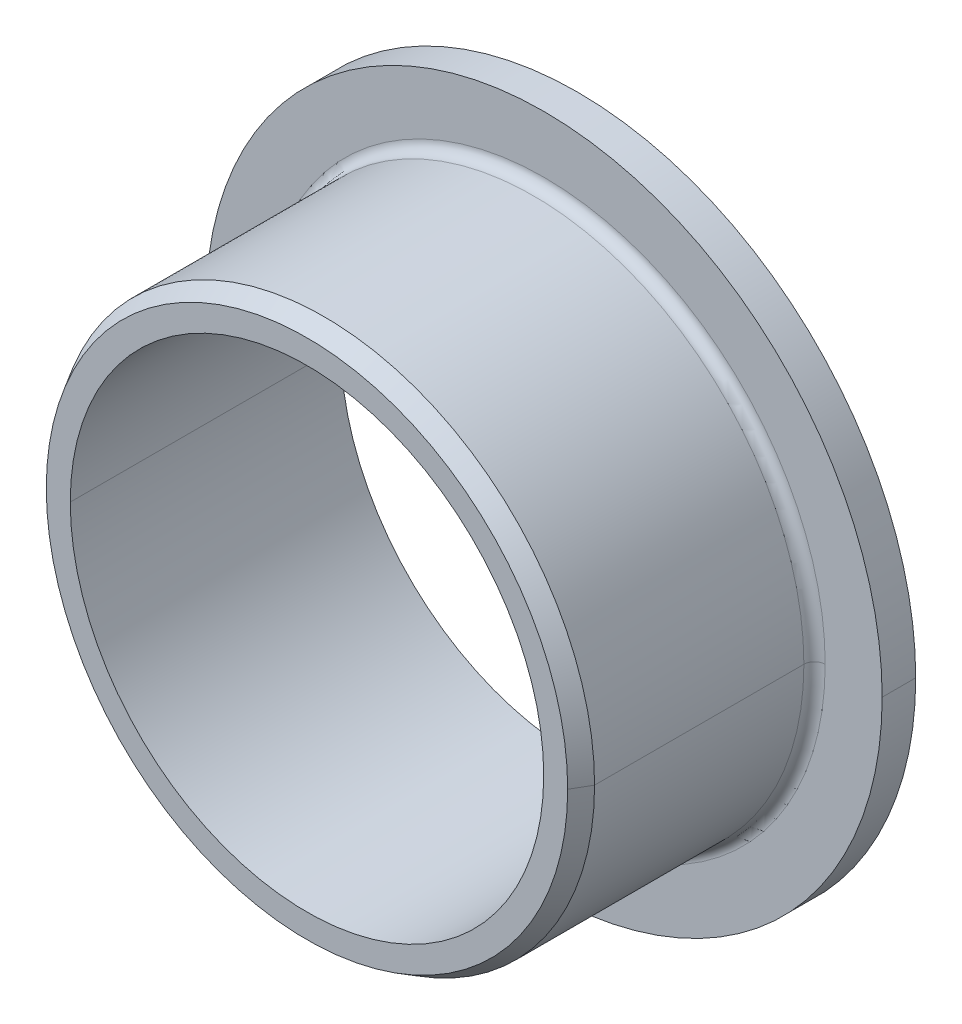
ISO-10303-21;
HEADER;
FILE_DESCRIPTION(('STEP AP214'),'2;1');
FILE_NAME('part.step','',(''),(''),'','','');
FILE_SCHEMA(('AUTOMOTIVE_DESIGN { 1 0 10303 214 1 1 1 1 }'));
ENDSEC;
DATA;
#1=APPLICATION_CONTEXT('core data for automotive mechanical design processes');
#2=APPLICATION_PROTOCOL_DEFINITION('international standard','automotive_design',2000,#1);
#3=PRODUCT_CONTEXT('',#1,'mechanical');
#4=PRODUCT('Part','Part','',(#3));
#5=PRODUCT_RELATED_PRODUCT_CATEGORY('part','',(#4));
#6=PRODUCT_DEFINITION_FORMATION('','',#4);
#7=PRODUCT_DEFINITION_CONTEXT('part definition',#1,'design');
#8=PRODUCT_DEFINITION('design','',#6,#7);
#9=PRODUCT_DEFINITION_SHAPE('','',#8);
#10=(LENGTH_UNIT() NAMED_UNIT(*) SI_UNIT(.MILLI.,.METRE.));
#11=(NAMED_UNIT(*) PLANE_ANGLE_UNIT() SI_UNIT($,.RADIAN.));
#12=(NAMED_UNIT(*) SI_UNIT($,.STERADIAN.) SOLID_ANGLE_UNIT());
#13=UNCERTAINTY_MEASURE_WITH_UNIT(LENGTH_MEASURE(1.E-05),#10,'distance_accuracy_value','');
#14=(GEOMETRIC_REPRESENTATION_CONTEXT(3) GLOBAL_UNCERTAINTY_ASSIGNED_CONTEXT((#13)) GLOBAL_UNIT_ASSIGNED_CONTEXT((#10,
#11,#12)) REPRESENTATION_CONTEXT('',''));
#15=CARTESIAN_POINT('',(0.,0.,0.));
#16=DIRECTION('',(0.,0.,1.));
#17=DIRECTION('',(1.,0.,0.));
#18=AXIS2_PLACEMENT_3D('',#15,#16,#17);
#19=CARTESIAN_POINT('',(13.49375,0.,0.));
#20=DIRECTION('',(0.,0.,-1.));
#21=DIRECTION('',(0.,-1.,0.));
#22=AXIS2_PLACEMENT_3D('',#19,#20,#21);
#23=PLANE('',#22);
#24=CARTESIAN_POINT('',(0.,0.,0.));
#25=DIRECTION('',(0.,0.,1.));
#26=DIRECTION('',(1.,0.,0.));
#27=AXIS2_PLACEMENT_3D('',#24,#25,#26);
#28=CIRCLE('',#27,11.1125);
#29=CARTESIAN_POINT('',(11.1125,0.,0.));
#30=VERTEX_POINT('',#29);
#31=CARTESIAN_POINT('',(-11.1125,0.,0.));
#32=VERTEX_POINT('',#31);
#33=EDGE_CURVE('E10',#30,#32,#28,.T.);
#34=ORIENTED_EDGE('',*,*,#33,.T.);
#35=CARTESIAN_POINT('',(0.,0.,0.));
#36=DIRECTION('',(0.,0.,1.));
#37=DIRECTION('',(1.,0.,0.));
#38=AXIS2_PLACEMENT_3D('',#35,#36,#37);
#39=CIRCLE('',#38,11.1125);
#40=EDGE_CURVE('E163',#32,#30,#39,.T.);
#41=ORIENTED_EDGE('',*,*,#40,.T.);
#42=EDGE_LOOP('',(#34,#41));
#43=FACE_BOUND('',#42,.T.);
#44=CARTESIAN_POINT('',(0.,0.,0.));
#45=DIRECTION('',(0.,0.,1.));
#46=DIRECTION('',(1.,0.,0.));
#47=AXIS2_PLACEMENT_3D('',#44,#45,#46);
#48=CIRCLE('',#47,15.875);
#49=CARTESIAN_POINT('',(15.875,0.,0.));
#50=VERTEX_POINT('',#49);
#51=CARTESIAN_POINT('',(-15.875,0.,0.));
#52=VERTEX_POINT('',#51);
#53=EDGE_CURVE('E171',#50,#52,#48,.T.);
#54=ORIENTED_EDGE('',*,*,#53,.F.);
#55=CARTESIAN_POINT('',(0.,0.,0.));
#56=DIRECTION('',(0.,0.,1.));
#57=DIRECTION('',(1.,0.,0.));
#58=AXIS2_PLACEMENT_3D('',#55,#56,#57);
#59=CIRCLE('',#58,15.875);
#60=EDGE_CURVE('E143',#52,#50,#59,.T.);
#61=ORIENTED_EDGE('',*,*,#60,.F.);
#62=EDGE_LOOP('',(#54,#61));
#63=FACE_BOUND('',#62,.T.);
#64=ADVANCED_FACE('F16',(#43,#63),#23,.T.);
#65=CARTESIAN_POINT('',(0.,0.,6.35));
#66=DIRECTION('',(0.,0.,1.));
#67=DIRECTION('',(1.,0.,0.));
#68=AXIS2_PLACEMENT_3D('',#65,#66,#67);
#69=CYLINDRICAL_SURFACE('',#68,11.1125);
#70=DIRECTION('',(0.,0.,1.));
#71=VECTOR('',#70,1.);
#72=CARTESIAN_POINT('',(11.1125,0.,6.35));
#73=LINE('',#72,#71);
#74=CARTESIAN_POINT('',(11.1125,0.,12.7));
#75=VERTEX_POINT('',#74);
#76=EDGE_CURVE('E175',#30,#75,#73,.T.);
#77=ORIENTED_EDGE('',*,*,#76,.T.);
#78=CARTESIAN_POINT('',(0.,0.,12.7));
#79=DIRECTION('',(0.,0.,1.));
#80=DIRECTION('',(1.,0.,0.));
#81=AXIS2_PLACEMENT_3D('',#78,#79,#80);
#82=CIRCLE('',#81,11.1125);
#83=CARTESIAN_POINT('',(-11.1125,0.,12.7));
#84=VERTEX_POINT('',#83);
#85=EDGE_CURVE('E27',#75,#84,#82,.T.);
#86=ORIENTED_EDGE('',*,*,#85,.T.);
#87=DIRECTION('',(0.,0.,-1.));
#88=VECTOR('',#87,1.);
#89=CARTESIAN_POINT('',(-11.1125,0.,6.35));
#90=LINE('',#89,#88);
#91=EDGE_CURVE('E161',#84,#32,#90,.T.);
#92=ORIENTED_EDGE('',*,*,#91,.T.);
#93=ORIENTED_EDGE('',*,*,#33,.F.);
#94=EDGE_LOOP('',(#77,#86,#92,#93));
#95=FACE_BOUND('',#94,.T.);
#96=ADVANCED_FACE('F204',(#95),#69,.F.);
#97=CARTESIAN_POINT('',(11.6753098923,0.,12.7));
#98=DIRECTION('',(0.,0.,1.));
#99=DIRECTION('',(1.,0.,0.));
#100=AXIS2_PLACEMENT_3D('',#97,#98,#99);
#101=PLANE('',#100);
#102=ORIENTED_EDGE('',*,*,#85,.F.);
#103=CARTESIAN_POINT('',(0.,0.,12.7));
#104=DIRECTION('',(0.,0.,1.));
#105=DIRECTION('',(1.,0.,0.));
#106=AXIS2_PLACEMENT_3D('',#103,#104,#105);
#107=CIRCLE('',#106,11.1125);
#108=EDGE_CURVE('E137',#84,#75,#107,.T.);
#109=ORIENTED_EDGE('',*,*,#108,.F.);
#110=EDGE_LOOP('',(#102,#109));
#111=FACE_BOUND('',#110,.T.);
#112=CARTESIAN_POINT('',(0.,0.,12.7));
#113=DIRECTION('',(0.,0.,1.));
#114=DIRECTION('',(1.,0.,0.));
#115=AXIS2_PLACEMENT_3D('',#112,#113,#114);
#116=CIRCLE('',#115,12.2381197846);
#117=CARTESIAN_POINT('',(12.2381197846,0.,12.7));
#118=VERTEX_POINT('',#117);
#119=CARTESIAN_POINT('',(-12.2381197846,0.,12.7));
#120=VERTEX_POINT('',#119);
#121=EDGE_CURVE('E127',#118,#120,#116,.T.);
#122=ORIENTED_EDGE('',*,*,#121,.T.);
#123=CARTESIAN_POINT('',(0.,0.,12.7));
#124=DIRECTION('',(0.,0.,1.));
#125=DIRECTION('',(1.,0.,0.));
#126=AXIS2_PLACEMENT_3D('',#123,#124,#125);
#127=CIRCLE('',#126,12.2381197846);
#128=EDGE_CURVE('E88',#120,#118,#127,.T.);
#129=ORIENTED_EDGE('',*,*,#128,.T.);
#130=EDGE_LOOP('',(#122,#129));
#131=FACE_BOUND('',#130,.T.);
#132=ADVANCED_FACE('F266',(#111,#131),#101,.T.);
#133=CARTESIAN_POINT('',(0.,0.,12.3));
#134=DIRECTION('',(0.,0.,-1.));
#135=DIRECTION('',(1.,0.,0.));
#136=AXIS2_PLACEMENT_3D('',#133,#134,#135);
#137=CONICAL_SURFACE('',#136,12.4690598923,0.523598775643579);
#138=DIRECTION('',(-0.500000000039214,0.,0.866025403761799));
#139=VECTOR('',#138,1.);
#140=CARTESIAN_POINT('',(12.4690598923,0.,12.3));
#141=LINE('',#140,#139);
#142=CARTESIAN_POINT('',(12.7,0.,11.9));
#143=VERTEX_POINT('',#142);
#144=EDGE_CURVE('E130',#143,#118,#141,.T.);
#145=ORIENTED_EDGE('',*,*,#144,.T.);
#146=ORIENTED_EDGE('',*,*,#128,.F.);
#147=DIRECTION('',(-0.500000000039214,0.,-0.866025403761799));
#148=VECTOR('',#147,1.);
#149=CARTESIAN_POINT('',(-12.4690598923,0.,12.3));
#150=LINE('',#149,#148);
#151=CARTESIAN_POINT('',(-12.7,0.,11.9));
#152=VERTEX_POINT('',#151);
#153=EDGE_CURVE('E123',#120,#152,#150,.T.);
#154=ORIENTED_EDGE('',*,*,#153,.T.);
#155=CARTESIAN_POINT('',(0.,0.,11.9));
#156=DIRECTION('',(0.,0.,1.));
#157=DIRECTION('',(1.,0.,0.));
#158=AXIS2_PLACEMENT_3D('',#155,#156,#157);
#159=CIRCLE('',#158,12.7);
#160=EDGE_CURVE('E96',#152,#143,#159,.T.);
#161=ORIENTED_EDGE('',*,*,#160,.T.);
#162=EDGE_LOOP('',(#145,#146,#154,#161));
#163=FACE_BOUND('',#162,.T.);
#164=ADVANCED_FACE('F124',(#163),#137,.T.);
#165=CARTESIAN_POINT('',(0.,0.,6.9874));
#166=DIRECTION('',(0.,0.,1.));
#167=DIRECTION('',(1.,0.,0.));
#168=AXIS2_PLACEMENT_3D('',#165,#166,#167);
#169=CYLINDRICAL_SURFACE('',#168,12.7);
#170=DIRECTION('',(0.,0.,1.));
#171=VECTOR('',#170,1.);
#172=CARTESIAN_POINT('',(12.7,0.,6.9874));
#173=LINE('',#172,#171);
#174=CARTESIAN_POINT('',(12.7,0.,2.0748));
#175=VERTEX_POINT('',#174);
#176=EDGE_CURVE('E104',#175,#143,#173,.T.);
#177=ORIENTED_EDGE('',*,*,#176,.T.);
#178=ORIENTED_EDGE('',*,*,#160,.F.);
#179=DIRECTION('',(0.,0.,-1.));
#180=VECTOR('',#179,1.);
#181=CARTESIAN_POINT('',(-12.7,0.,6.9874));
#182=LINE('',#181,#180);
#183=CARTESIAN_POINT('',(-12.7,0.,2.0748));
#184=VERTEX_POINT('',#183);
#185=EDGE_CURVE('E101',#152,#184,#182,.T.);
#186=ORIENTED_EDGE('',*,*,#185,.T.);
#187=CARTESIAN_POINT('',(0.,0.,2.0748));
#188=DIRECTION('',(0.,0.,1.));
#189=DIRECTION('',(1.,0.,0.));
#190=AXIS2_PLACEMENT_3D('',#187,#188,#189);
#191=CIRCLE('',#190,12.7);
#192=EDGE_CURVE('E189',#184,#175,#191,.T.);
#193=ORIENTED_EDGE('',*,*,#192,.T.);
#194=EDGE_LOOP('',(#177,#178,#186,#193));
#195=FACE_BOUND('',#194,.T.);
#196=ADVANCED_FACE('F98',(#195),#169,.T.);
#197=CARTESIAN_POINT('',(0.,0.,2.0748));
#198=DIRECTION('',(0.,0.,1.));
#199=DIRECTION('',(1.,0.,0.));
#200=AXIS2_PLACEMENT_3D('',#197,#198,#199);
#201=TOROIDAL_SURFACE('',#200,13.2,0.5);
#202=CARTESIAN_POINT('',(-13.2,0.,2.0748));
#203=DIRECTION('',(0.,-1.,0.));
#204=DIRECTION('',(-1.,0.,0.));
#205=AXIS2_PLACEMENT_3D('',#202,#203,#204);
#206=CIRCLE('',#205,0.5);
#207=CARTESIAN_POINT('',(-13.2,0.,1.5748));
#208=VERTEX_POINT('',#207);
#209=EDGE_CURVE('E120',#208,#184,#206,.T.);
#210=ORIENTED_EDGE('',*,*,#209,.T.);
#211=CARTESIAN_POINT('',(0.,0.,2.0748));
#212=DIRECTION('',(0.,0.,1.));
#213=DIRECTION('',(1.,0.,0.));
#214=AXIS2_PLACEMENT_3D('',#211,#212,#213);
#215=CIRCLE('',#214,12.7);
#216=EDGE_CURVE('E118',#175,#184,#215,.T.);
#217=ORIENTED_EDGE('',*,*,#216,.F.);
#218=CARTESIAN_POINT('',(13.2,0.,2.0748));
#219=DIRECTION('',(0.,-1.,0.));
#220=DIRECTION('',(1.,0.,0.));
#221=AXIS2_PLACEMENT_3D('',#218,#219,#220);
#222=CIRCLE('',#221,0.5);
#223=CARTESIAN_POINT('',(13.2,0.,1.5748));
#224=VERTEX_POINT('',#223);
#225=EDGE_CURVE('E141',#175,#224,#222,.T.);
#226=ORIENTED_EDGE('',*,*,#225,.T.);
#227=CARTESIAN_POINT('',(0.,0.,1.5748));
#228=DIRECTION('',(0.,0.,1.));
#229=DIRECTION('',(1.,0.,0.));
#230=AXIS2_PLACEMENT_3D('',#227,#228,#229);
#231=CIRCLE('',#230,13.2);
#232=EDGE_CURVE('E110',#224,#208,#231,.T.);
#233=ORIENTED_EDGE('',*,*,#232,.T.);
#234=EDGE_LOOP('',(#210,#217,#226,#233));
#235=FACE_BOUND('',#234,.T.);
#236=ADVANCED_FACE('F236',(#235),#201,.F.);
#237=CARTESIAN_POINT('',(14.5375,0.,1.5748));
#238=DIRECTION('',(0.,0.,1.));
#239=DIRECTION('',(1.,0.,0.));
#240=AXIS2_PLACEMENT_3D('',#237,#238,#239);
#241=PLANE('',#240);
#242=ORIENTED_EDGE('',*,*,#232,.F.);
#243=CARTESIAN_POINT('',(0.,0.,1.5748));
#244=DIRECTION('',(0.,0.,1.));
#245=DIRECTION('',(1.,0.,0.));
#246=AXIS2_PLACEMENT_3D('',#243,#244,#245);
#247=CIRCLE('',#246,13.2);
#248=EDGE_CURVE('E176',#208,#224,#247,.T.);
#249=ORIENTED_EDGE('',*,*,#248,.F.);
#250=EDGE_LOOP('',(#242,#249));
#251=FACE_BOUND('',#250,.T.);
#252=CARTESIAN_POINT('',(0.,0.,1.5748));
#253=DIRECTION('',(0.,0.,1.));
#254=DIRECTION('',(1.,0.,0.));
#255=AXIS2_PLACEMENT_3D('',#252,#253,#254);
#256=CIRCLE('',#255,15.875);
#257=CARTESIAN_POINT('',(15.875,0.,1.5748));
#258=VERTEX_POINT('',#257);
#259=CARTESIAN_POINT('',(-15.875,0.,1.5748));
#260=VERTEX_POINT('',#259);
#261=EDGE_CURVE('E166',#258,#260,#256,.T.);
#262=ORIENTED_EDGE('',*,*,#261,.T.);
#263=CARTESIAN_POINT('',(0.,0.,1.5748));
#264=DIRECTION('',(0.,0.,1.));
#265=DIRECTION('',(1.,0.,0.));
#266=AXIS2_PLACEMENT_3D('',#263,#264,#265);
#267=CIRCLE('',#266,15.875);
#268=EDGE_CURVE('E40',#260,#258,#267,.T.);
#269=ORIENTED_EDGE('',*,*,#268,.T.);
#270=EDGE_LOOP('',(#262,#269));
#271=FACE_BOUND('',#270,.T.);
#272=ADVANCED_FACE('F230',(#251,#271),#241,.T.);
#273=CARTESIAN_POINT('',(0.,0.,0.7874));
#274=DIRECTION('',(0.,0.,1.));
#275=DIRECTION('',(1.,0.,0.));
#276=AXIS2_PLACEMENT_3D('',#273,#274,#275);
#277=CYLINDRICAL_SURFACE('',#276,15.875);
#278=DIRECTION('',(0.,0.,1.));
#279=VECTOR('',#278,1.);
#280=CARTESIAN_POINT('',(15.875,0.,0.7874));
#281=LINE('',#280,#279);
#282=EDGE_CURVE('E20',#50,#258,#281,.T.);
#283=ORIENTED_EDGE('',*,*,#282,.T.);
#284=ORIENTED_EDGE('',*,*,#268,.F.);
#285=DIRECTION('',(0.,0.,-1.));
#286=VECTOR('',#285,1.);
#287=CARTESIAN_POINT('',(-15.875,0.,0.7874));
#288=LINE('',#287,#286);
#289=EDGE_CURVE('E168',#260,#52,#288,.T.);
#290=ORIENTED_EDGE('',*,*,#289,.T.);
#291=ORIENTED_EDGE('',*,*,#60,.T.);
#292=EDGE_LOOP('',(#283,#284,#290,#291));
#293=FACE_BOUND('',#292,.T.);
#294=ADVANCED_FACE('F235',(#293),#277,.T.);
#295=CARTESIAN_POINT('',(0.,0.,0.7874));
#296=DIRECTION('',(0.,0.,1.));
#297=DIRECTION('',(1.,0.,0.));
#298=AXIS2_PLACEMENT_3D('',#295,#296,#297);
#299=CYLINDRICAL_SURFACE('',#298,15.875);
#300=ORIENTED_EDGE('',*,*,#282,.F.);
#301=ORIENTED_EDGE('',*,*,#53,.T.);
#302=ORIENTED_EDGE('',*,*,#289,.F.);
#303=ORIENTED_EDGE('',*,*,#261,.F.);
#304=EDGE_LOOP('',(#300,#301,#302,#303));
#305=FACE_BOUND('',#304,.T.);
#306=ADVANCED_FACE('F18',(#305),#299,.T.);
#307=CARTESIAN_POINT('',(0.,0.,2.0748));
#308=DIRECTION('',(0.,0.,1.));
#309=DIRECTION('',(1.,0.,0.));
#310=AXIS2_PLACEMENT_3D('',#307,#308,#309);
#311=TOROIDAL_SURFACE('',#310,13.2,0.5);
#312=ORIENTED_EDGE('',*,*,#209,.F.);
#313=ORIENTED_EDGE('',*,*,#248,.T.);
#314=ORIENTED_EDGE('',*,*,#225,.F.);
#315=ORIENTED_EDGE('',*,*,#192,.F.);
#316=EDGE_LOOP('',(#312,#313,#314,#315));
#317=FACE_BOUND('',#316,.T.);
#318=ADVANCED_FACE('F222',(#317),#311,.F.);
#319=CARTESIAN_POINT('',(0.,0.,6.9874));
#320=DIRECTION('',(0.,0.,1.));
#321=DIRECTION('',(1.,0.,0.));
#322=AXIS2_PLACEMENT_3D('',#319,#320,#321);
#323=CYLINDRICAL_SURFACE('',#322,12.7);
#324=ORIENTED_EDGE('',*,*,#176,.F.);
#325=ORIENTED_EDGE('',*,*,#216,.T.);
#326=ORIENTED_EDGE('',*,*,#185,.F.);
#327=CARTESIAN_POINT('',(0.,0.,11.9));
#328=DIRECTION('',(0.,0.,1.));
#329=DIRECTION('',(1.,0.,0.));
#330=AXIS2_PLACEMENT_3D('',#327,#328,#329);
#331=CIRCLE('',#330,12.7);
#332=EDGE_CURVE('E115',#143,#152,#331,.T.);
#333=ORIENTED_EDGE('',*,*,#332,.F.);
#334=EDGE_LOOP('',(#324,#325,#326,#333));
#335=FACE_BOUND('',#334,.T.);
#336=ADVANCED_FACE('F113',(#335),#323,.T.);
#337=CARTESIAN_POINT('',(0.,0.,12.3));
#338=DIRECTION('',(0.,0.,-1.));
#339=DIRECTION('',(1.,0.,0.));
#340=AXIS2_PLACEMENT_3D('',#337,#338,#339);
#341=CONICAL_SURFACE('',#340,12.4690598923,0.523598775643579);
#342=ORIENTED_EDGE('',*,*,#144,.F.);
#343=ORIENTED_EDGE('',*,*,#332,.T.);
#344=ORIENTED_EDGE('',*,*,#153,.F.);
#345=ORIENTED_EDGE('',*,*,#121,.F.);
#346=EDGE_LOOP('',(#342,#343,#344,#345));
#347=FACE_BOUND('',#346,.T.);
#348=ADVANCED_FACE('F129',(#347),#341,.T.);
#349=CARTESIAN_POINT('',(0.,0.,6.35));
#350=DIRECTION('',(0.,0.,1.));
#351=DIRECTION('',(1.,0.,0.));
#352=AXIS2_PLACEMENT_3D('',#349,#350,#351);
#353=CYLINDRICAL_SURFACE('',#352,11.1125);
#354=ORIENTED_EDGE('',*,*,#76,.F.);
#355=ORIENTED_EDGE('',*,*,#40,.F.);
#356=ORIENTED_EDGE('',*,*,#91,.F.);
#357=ORIENTED_EDGE('',*,*,#108,.T.);
#358=EDGE_LOOP('',(#354,#355,#356,#357));
#359=FACE_BOUND('',#358,.T.);
#360=ADVANCED_FACE('F201',(#359),#353,.F.);
#361=CLOSED_SHELL('',(#64,#96,#132,#164,#196,#236,#272,#294,#306,#318,#336,#348,#360));
#362=MANIFOLD_SOLID_BREP('B1',#361);
#363=ADVANCED_BREP_SHAPE_REPRESENTATION('',(#18,#362),#14);
#364=SHAPE_DEFINITION_REPRESENTATION(#9,#363);
ENDSEC;
END-ISO-10303-21;
